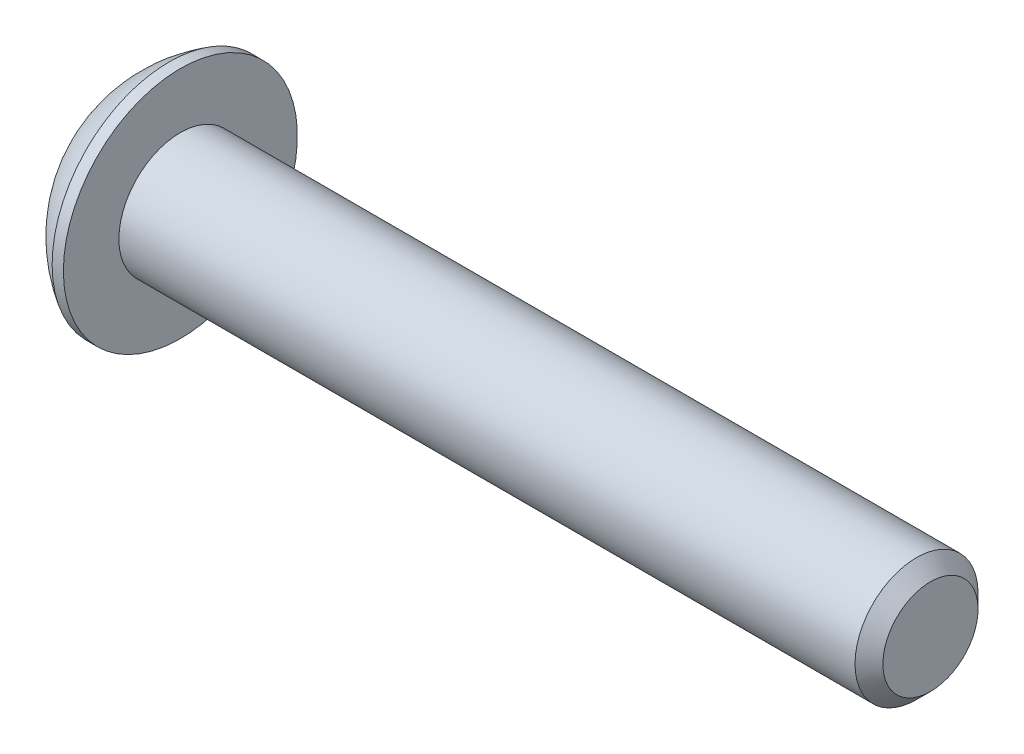
ISO-10303-21;
HEADER;
FILE_DESCRIPTION(('STEP AP214'),'2;1');
FILE_NAME('part.step','',(''),(''),'','','');
FILE_SCHEMA(('AUTOMOTIVE_DESIGN { 1 0 10303 214 1 1 1 1 }'));
ENDSEC;
DATA;
#1=APPLICATION_CONTEXT('core data for automotive mechanical design processes');
#2=APPLICATION_PROTOCOL_DEFINITION('international standard','automotive_design',2000,#1);
#3=PRODUCT_CONTEXT('',#1,'mechanical');
#4=PRODUCT('Part','Part','',(#3));
#5=PRODUCT_RELATED_PRODUCT_CATEGORY('part','',(#4));
#6=PRODUCT_DEFINITION_FORMATION('','',#4);
#7=PRODUCT_DEFINITION_CONTEXT('part definition',#1,'design');
#8=PRODUCT_DEFINITION('design','',#6,#7);
#9=PRODUCT_DEFINITION_SHAPE('','',#8);
#10=(LENGTH_UNIT() NAMED_UNIT(*) SI_UNIT(.MILLI.,.METRE.));
#11=(NAMED_UNIT(*) PLANE_ANGLE_UNIT() SI_UNIT($,.RADIAN.));
#12=(NAMED_UNIT(*) SI_UNIT($,.STERADIAN.) SOLID_ANGLE_UNIT());
#13=UNCERTAINTY_MEASURE_WITH_UNIT(LENGTH_MEASURE(1.E-05),#10,'distance_accuracy_value','');
#14=(GEOMETRIC_REPRESENTATION_CONTEXT(3) GLOBAL_UNCERTAINTY_ASSIGNED_CONTEXT((#13)) GLOBAL_UNIT_ASSIGNED_CONTEXT((#10,
#11,#12)) REPRESENTATION_CONTEXT('',''));
#15=CARTESIAN_POINT('',(0.,0.,0.));
#16=DIRECTION('',(0.,0.,1.));
#17=DIRECTION('',(1.,0.,0.));
#18=AXIS2_PLACEMENT_3D('',#15,#16,#17);
#19=CARTESIAN_POINT('',(1.32080000000034,0.,0.));
#20=DIRECTION('',(-1.,0.,0.));
#21=DIRECTION('',(0.,0.,1.));
#22=AXIS2_PLACEMENT_3D('',#19,#20,#21);
#23=CONICAL_SURFACE('',#22,1.1937999999998,1.04719755119608);
#24=CARTESIAN_POINT('',(2.01004075135902,0.,4.44089209850063E-13));
#25=VERTEX_POINT('',#24);
#26=VERTEX_LOOP('',#25);
#27=FACE_BOUND('',#26,.T.);
#28=CARTESIAN_POINT('',(1.32080000000009,0.,0.));
#29=DIRECTION('',(-1.,0.,0.));
#30=DIRECTION('',(0.,0.,1.));
#31=AXIS2_PLACEMENT_3D('',#28,#29,#30);
#32=CIRCLE('',#31,1.19380000000024);
#33=CARTESIAN_POINT('',(1.32080000000004,-1.03386112703797,0.59690000000006));
#34=VERTEX_POINT('',#33);
#35=CARTESIAN_POINT('',(1.32080000000004,0.,1.19380000000012));
#36=VERTEX_POINT('',#35);
#37=EDGE_CURVE('E19',#34,#36,#32,.T.);
#38=ORIENTED_EDGE('',*,*,#37,.T.);
#39=CARTESIAN_POINT('',(1.32080000000009,0.,0.));
#40=DIRECTION('',(-1.,0.,0.));
#41=DIRECTION('',(0.,0.,1.));
#42=AXIS2_PLACEMENT_3D('',#39,#40,#41);
#43=CIRCLE('',#42,1.19380000000024);
#44=CARTESIAN_POINT('',(1.32080000000004,1.03386112703797,0.596900000000061));
#45=VERTEX_POINT('',#44);
#46=EDGE_CURVE('E148',#36,#45,#43,.T.);
#47=ORIENTED_EDGE('',*,*,#46,.T.);
#48=CARTESIAN_POINT('',(1.32080000000009,0.,0.));
#49=DIRECTION('',(-1.,0.,0.));
#50=DIRECTION('',(0.,0.,1.));
#51=AXIS2_PLACEMENT_3D('',#48,#49,#50);
#52=CIRCLE('',#51,1.19380000000024);
#53=CARTESIAN_POINT('',(1.32080000000004,1.03386112703797,-0.596900000000061));
#54=VERTEX_POINT('',#53);
#55=EDGE_CURVE('E318',#45,#54,#52,.T.);
#56=ORIENTED_EDGE('',*,*,#55,.T.);
#57=CARTESIAN_POINT('',(1.32080000000009,0.,0.));
#58=DIRECTION('',(-1.,0.,0.));
#59=DIRECTION('',(0.,0.,1.));
#60=AXIS2_PLACEMENT_3D('',#57,#58,#59);
#61=CIRCLE('',#60,1.19380000000024);
#62=CARTESIAN_POINT('',(1.32080000000004,1.49457637585666E-12,-1.19380000000012));
#63=VERTEX_POINT('',#62);
#64=EDGE_CURVE('E319',#54,#63,#61,.T.);
#65=ORIENTED_EDGE('',*,*,#64,.T.);
#66=CARTESIAN_POINT('',(1.32080000000009,0.,0.));
#67=DIRECTION('',(-1.,0.,0.));
#68=DIRECTION('',(0.,0.,1.));
#69=AXIS2_PLACEMENT_3D('',#66,#67,#68);
#70=CIRCLE('',#69,1.19380000000024);
#71=CARTESIAN_POINT('',(1.32080000000004,-1.03386112703797,-0.59690000000006));
#72=VERTEX_POINT('',#71);
#73=EDGE_CURVE('E92',#63,#72,#70,.T.);
#74=ORIENTED_EDGE('',*,*,#73,.T.);
#75=CARTESIAN_POINT('',(1.32080000000009,0.,0.));
#76=DIRECTION('',(-1.,0.,0.));
#77=DIRECTION('',(0.,0.,1.));
#78=AXIS2_PLACEMENT_3D('',#75,#76,#77);
#79=CIRCLE('',#78,1.19380000000024);
#80=EDGE_CURVE('E88',#72,#34,#79,.T.);
#81=ORIENTED_EDGE('',*,*,#80,.T.);
#82=EDGE_LOOP('',(#38,#47,#56,#65,#74,#81));
#83=FACE_BOUND('',#82,.T.);
#84=ADVANCED_FACE('F16',(#27,#83),#23,.F.);
#85=CARTESIAN_POINT('',(1.3208,-2.06772225407572,-1.1938));
#86=DIRECTION('',(1.,0.,0.));
#87=DIRECTION('',(0.,0.,-1.));
#88=AXIS2_PLACEMENT_3D('',#85,#86,#87);
#89=PLANE('',#88);
#90=DIRECTION('',(0.,0.5,0.866025403784439));
#91=VECTOR('',#90,1.);
#92=CARTESIAN_POINT('',(1.3208,-1.37848150271715,0.));
#93=LINE('',#92,#91);
#94=CARTESIAN_POINT('',(1.3208,-0.689240751358574,1.1938));
#95=VERTEX_POINT('',#94);
#96=EDGE_CURVE('E100',#95,#34,#93,.F.);
#97=ORIENTED_EDGE('',*,*,#96,.F.);
#98=DIRECTION('',(0.,1.,0.));
#99=VECTOR('',#98,1.);
#100=CARTESIAN_POINT('',(1.3208,-0.689240751358574,1.1938));
#101=LINE('',#100,#99);
#102=EDGE_CURVE('E102',#36,#95,#101,.F.);
#103=ORIENTED_EDGE('',*,*,#102,.F.);
#104=ORIENTED_EDGE('',*,*,#37,.F.);
#105=EDGE_LOOP('',(#97,#103,#104));
#106=FACE_BOUND('',#105,.T.);
#107=ADVANCED_FACE('F98',(#106),#89,.F.);
#108=CARTESIAN_POINT('',(1.3208,-2.06772225407572,-1.1938));
#109=DIRECTION('',(1.,0.,0.));
#110=DIRECTION('',(0.,0.,-1.));
#111=AXIS2_PLACEMENT_3D('',#108,#109,#110);
#112=PLANE('',#111);
#113=DIRECTION('',(0.,-0.5,0.866025403784439));
#114=VECTOR('',#113,1.);
#115=CARTESIAN_POINT('',(1.3208,-0.689240751358574,-1.1938));
#116=LINE('',#115,#114);
#117=CARTESIAN_POINT('',(1.3208,-1.37848150271715,0.));
#118=VERTEX_POINT('',#117);
#119=EDGE_CURVE('E108',#118,#72,#116,.F.);
#120=ORIENTED_EDGE('',*,*,#119,.F.);
#121=DIRECTION('',(0.,0.5,0.866025403784439));
#122=VECTOR('',#121,1.);
#123=CARTESIAN_POINT('',(1.3208,-1.37848150271715,0.));
#124=LINE('',#123,#122);
#125=EDGE_CURVE('E105',#34,#118,#124,.F.);
#126=ORIENTED_EDGE('',*,*,#125,.F.);
#127=ORIENTED_EDGE('',*,*,#80,.F.);
#128=EDGE_LOOP('',(#120,#126,#127));
#129=FACE_BOUND('',#128,.T.);
#130=ADVANCED_FACE('F106',(#129),#112,.F.);
#131=CARTESIAN_POINT('',(1.3208,-2.06772225407572,-1.1938));
#132=DIRECTION('',(1.,0.,0.));
#133=DIRECTION('',(0.,0.,-1.));
#134=AXIS2_PLACEMENT_3D('',#131,#132,#133);
#135=PLANE('',#134);
#136=DIRECTION('',(0.,1.,0.));
#137=VECTOR('',#136,1.);
#138=CARTESIAN_POINT('',(1.3208,0.689240751358577,-1.1938));
#139=LINE('',#138,#137);
#140=CARTESIAN_POINT('',(1.3208,-0.689240751358574,-1.1938));
#141=VERTEX_POINT('',#140);
#142=EDGE_CURVE('E288',#141,#63,#139,.T.);
#143=ORIENTED_EDGE('',*,*,#142,.F.);
#144=DIRECTION('',(0.,-0.5,0.866025403784439));
#145=VECTOR('',#144,1.);
#146=CARTESIAN_POINT('',(1.3208,-0.689240751358574,-1.1938));
#147=LINE('',#146,#145);
#148=EDGE_CURVE('E300',#72,#141,#147,.F.);
#149=ORIENTED_EDGE('',*,*,#148,.F.);
#150=ORIENTED_EDGE('',*,*,#73,.F.);
#151=EDGE_LOOP('',(#143,#149,#150));
#152=FACE_BOUND('',#151,.T.);
#153=ADVANCED_FACE('F191',(#152),#135,.F.);
#154=CARTESIAN_POINT('',(1.3208,-2.06772225407572,-1.1938));
#155=DIRECTION('',(1.,0.,0.));
#156=DIRECTION('',(0.,0.,-1.));
#157=AXIS2_PLACEMENT_3D('',#154,#155,#156);
#158=PLANE('',#157);
#159=DIRECTION('',(0.,-0.5,-0.866025403784439));
#160=VECTOR('',#159,1.);
#161=CARTESIAN_POINT('',(1.3208,1.37848150271715,0.));
#162=LINE('',#161,#160);
#163=CARTESIAN_POINT('',(1.3208,0.689240751358577,-1.1938));
#164=VERTEX_POINT('',#163);
#165=EDGE_CURVE('E274',#164,#54,#162,.F.);
#166=ORIENTED_EDGE('',*,*,#165,.F.);
#167=DIRECTION('',(0.,1.,0.));
#168=VECTOR('',#167,1.);
#169=CARTESIAN_POINT('',(1.3208,0.689240751358577,-1.1938));
#170=LINE('',#169,#168);
#171=EDGE_CURVE('E285',#63,#164,#170,.T.);
#172=ORIENTED_EDGE('',*,*,#171,.F.);
#173=ORIENTED_EDGE('',*,*,#64,.F.);
#174=EDGE_LOOP('',(#166,#172,#173));
#175=FACE_BOUND('',#174,.T.);
#176=ADVANCED_FACE('F187',(#175),#158,.F.);
#177=CARTESIAN_POINT('',(1.3208,-2.06772225407572,-1.1938));
#178=DIRECTION('',(1.,0.,0.));
#179=DIRECTION('',(0.,0.,-1.));
#180=AXIS2_PLACEMENT_3D('',#177,#178,#179);
#181=PLANE('',#180);
#182=DIRECTION('',(0.,0.5,-0.866025403784439));
#183=VECTOR('',#182,1.);
#184=CARTESIAN_POINT('',(1.3208,0.689240751358576,1.1938));
#185=LINE('',#184,#183);
#186=CARTESIAN_POINT('',(1.3208,1.37848150271715,0.));
#187=VERTEX_POINT('',#186);
#188=EDGE_CURVE('E253',#187,#45,#185,.F.);
#189=ORIENTED_EDGE('',*,*,#188,.F.);
#190=DIRECTION('',(0.,-0.5,-0.866025403784439));
#191=VECTOR('',#190,1.);
#192=CARTESIAN_POINT('',(1.3208,1.37848150271715,0.));
#193=LINE('',#192,#191);
#194=EDGE_CURVE('E272',#54,#187,#193,.F.);
#195=ORIENTED_EDGE('',*,*,#194,.F.);
#196=ORIENTED_EDGE('',*,*,#55,.F.);
#197=EDGE_LOOP('',(#189,#195,#196));
#198=FACE_BOUND('',#197,.T.);
#199=ADVANCED_FACE('F183',(#198),#181,.F.);
#200=CARTESIAN_POINT('',(1.3208,-2.06772225407572,-1.1938));
#201=DIRECTION('',(1.,0.,0.));
#202=DIRECTION('',(0.,0.,-1.));
#203=AXIS2_PLACEMENT_3D('',#200,#201,#202);
#204=PLANE('',#203);
#205=DIRECTION('',(0.,1.,0.));
#206=VECTOR('',#205,1.);
#207=CARTESIAN_POINT('',(1.3208,-0.689240751358574,1.1938));
#208=LINE('',#207,#206);
#209=CARTESIAN_POINT('',(1.3208,0.689240751358576,1.1938));
#210=VERTEX_POINT('',#209);
#211=EDGE_CURVE('E117',#210,#36,#208,.F.);
#212=ORIENTED_EDGE('',*,*,#211,.F.);
#213=DIRECTION('',(0.,0.5,-0.866025403784439));
#214=VECTOR('',#213,1.);
#215=CARTESIAN_POINT('',(1.3208,0.689240751358576,1.1938));
#216=LINE('',#215,#214);
#217=EDGE_CURVE('E256',#45,#210,#216,.F.);
#218=ORIENTED_EDGE('',*,*,#217,.F.);
#219=ORIENTED_EDGE('',*,*,#46,.F.);
#220=EDGE_LOOP('',(#212,#218,#219));
#221=FACE_BOUND('',#220,.T.);
#222=ADVANCED_FACE('F179',(#221),#204,.F.);
#223=CARTESIAN_POINT('',(1.3208,-0.689240751358574,1.1938));
#224=DIRECTION('',(0.,0.,-1.));
#225=DIRECTION('',(0.,1.,0.));
#226=AXIS2_PLACEMENT_3D('',#223,#224,#225);
#227=PLANE('',#226);
#228=DIRECTION('',(0.,1.,0.));
#229=VECTOR('',#228,1.);
#230=CARTESIAN_POINT('',(0.,0.,1.1938));
#231=LINE('',#230,#229);
#232=CARTESIAN_POINT('',(0.,0.689240751358577,1.1938));
#233=VERTEX_POINT('',#232);
#234=CARTESIAN_POINT('',(0.,-0.689240751358574,1.1938));
#235=VERTEX_POINT('',#234);
#236=EDGE_CURVE('E250',#233,#235,#231,.F.);
#237=ORIENTED_EDGE('',*,*,#236,.F.);
#238=DIRECTION('',(1.,0.,0.));
#239=VECTOR('',#238,1.);
#240=CARTESIAN_POINT('',(1.3208,0.689240751358576,1.1938));
#241=LINE('',#240,#239);
#242=EDGE_CURVE('E262',#210,#233,#241,.F.);
#243=ORIENTED_EDGE('',*,*,#242,.F.);
#244=ORIENTED_EDGE('',*,*,#211,.T.);
#245=ORIENTED_EDGE('',*,*,#102,.T.);
#246=DIRECTION('',(1.,0.,0.));
#247=VECTOR('',#246,1.);
#248=CARTESIAN_POINT('',(1.3208,-0.689240751358574,1.1938));
#249=LINE('',#248,#247);
#250=EDGE_CURVE('E111',#235,#95,#249,.T.);
#251=ORIENTED_EDGE('',*,*,#250,.F.);
#252=EDGE_LOOP('',(#237,#243,#244,#245,#251));
#253=FACE_BOUND('',#252,.T.);
#254=ADVANCED_FACE('F176',(#253),#227,.T.);
#255=CARTESIAN_POINT('',(1.3208,-1.37848150271715,0.));
#256=DIRECTION('',(0.,0.866025403784439,-0.5));
#257=DIRECTION('',(0.,0.5,0.866025403784439));
#258=AXIS2_PLACEMENT_3D('',#255,#256,#257);
#259=PLANE('',#258);
#260=DIRECTION('',(0.,-0.5,-0.866025403784439));
#261=VECTOR('',#260,1.);
#262=CARTESIAN_POINT('',(0.,-0.689240751358574,1.1938));
#263=LINE('',#262,#261);
#264=CARTESIAN_POINT('',(0.,-1.37848150271715,0.));
#265=VERTEX_POINT('',#264);
#266=EDGE_CURVE('E247',#235,#265,#263,.T.);
#267=ORIENTED_EDGE('',*,*,#266,.F.);
#268=ORIENTED_EDGE('',*,*,#250,.T.);
#269=ORIENTED_EDGE('',*,*,#96,.T.);
#270=ORIENTED_EDGE('',*,*,#125,.T.);
#271=DIRECTION('',(1.,0.,0.));
#272=VECTOR('',#271,1.);
#273=CARTESIAN_POINT('',(1.3208,-1.37848150271715,0.));
#274=LINE('',#273,#272);
#275=EDGE_CURVE('E297',#265,#118,#274,.T.);
#276=ORIENTED_EDGE('',*,*,#275,.F.);
#277=EDGE_LOOP('',(#267,#268,#269,#270,#276));
#278=FACE_BOUND('',#277,.T.);
#279=ADVANCED_FACE('F115',(#278),#259,.T.);
#280=CARTESIAN_POINT('',(1.3208,-0.689240751358574,-1.1938));
#281=DIRECTION('',(0.,0.866025403784439,0.5));
#282=DIRECTION('',(0.,-0.5,0.866025403784439));
#283=AXIS2_PLACEMENT_3D('',#280,#281,#282);
#284=PLANE('',#283);
#285=DIRECTION('',(0.,0.5,-0.866025403784439));
#286=VECTOR('',#285,1.);
#287=CARTESIAN_POINT('',(0.,-1.37848150271715,0.));
#288=LINE('',#287,#286);
#289=CARTESIAN_POINT('',(0.,-0.689240751358574,-1.1938));
#290=VERTEX_POINT('',#289);
#291=EDGE_CURVE('E244',#265,#290,#288,.T.);
#292=ORIENTED_EDGE('',*,*,#291,.F.);
#293=ORIENTED_EDGE('',*,*,#275,.T.);
#294=ORIENTED_EDGE('',*,*,#119,.T.);
#295=ORIENTED_EDGE('',*,*,#148,.T.);
#296=DIRECTION('',(1.,0.,0.));
#297=VECTOR('',#296,1.);
#298=CARTESIAN_POINT('',(1.3208,-0.689240751358574,-1.1938));
#299=LINE('',#298,#297);
#300=EDGE_CURVE('E282',#290,#141,#299,.T.);
#301=ORIENTED_EDGE('',*,*,#300,.F.);
#302=EDGE_LOOP('',(#292,#293,#294,#295,#301));
#303=FACE_BOUND('',#302,.T.);
#304=ADVANCED_FACE('F169',(#303),#284,.T.);
#305=CARTESIAN_POINT('',(1.3208,0.689240751358577,-1.1938));
#306=DIRECTION('',(0.,0.,1.));
#307=DIRECTION('',(1.,0.,0.));
#308=AXIS2_PLACEMENT_3D('',#305,#306,#307);
#309=PLANE('',#308);
#310=DIRECTION('',(0.,1.,0.));
#311=VECTOR('',#310,1.);
#312=CARTESIAN_POINT('',(0.,0.,-1.1938));
#313=LINE('',#312,#311);
#314=CARTESIAN_POINT('',(0.,0.689240751358577,-1.1938));
#315=VERTEX_POINT('',#314);
#316=EDGE_CURVE('E241',#290,#315,#313,.T.);
#317=ORIENTED_EDGE('',*,*,#316,.F.);
#318=ORIENTED_EDGE('',*,*,#300,.T.);
#319=ORIENTED_EDGE('',*,*,#142,.T.);
#320=ORIENTED_EDGE('',*,*,#171,.T.);
#321=DIRECTION('',(1.,0.,0.));
#322=VECTOR('',#321,1.);
#323=CARTESIAN_POINT('',(1.3208,0.689240751358577,-1.1938));
#324=LINE('',#323,#322);
#325=EDGE_CURVE('E257',#315,#164,#324,.T.);
#326=ORIENTED_EDGE('',*,*,#325,.F.);
#327=EDGE_LOOP('',(#317,#318,#319,#320,#326));
#328=FACE_BOUND('',#327,.T.);
#329=ADVANCED_FACE('F166',(#328),#309,.T.);
#330=CARTESIAN_POINT('',(1.3208,1.37848150271715,0.));
#331=DIRECTION('',(0.,-0.866025403784439,0.5));
#332=DIRECTION('',(0.,-0.5,-0.866025403784439));
#333=AXIS2_PLACEMENT_3D('',#330,#331,#332);
#334=PLANE('',#333);
#335=DIRECTION('',(0.,0.5,0.866025403784439));
#336=VECTOR('',#335,1.);
#337=CARTESIAN_POINT('',(0.,0.689240751358577,-1.1938));
#338=LINE('',#337,#336);
#339=CARTESIAN_POINT('',(0.,1.37848150271715,0.));
#340=VERTEX_POINT('',#339);
#341=EDGE_CURVE('E238',#315,#340,#338,.T.);
#342=ORIENTED_EDGE('',*,*,#341,.F.);
#343=ORIENTED_EDGE('',*,*,#325,.T.);
#344=ORIENTED_EDGE('',*,*,#165,.T.);
#345=ORIENTED_EDGE('',*,*,#194,.T.);
#346=DIRECTION('',(1.,0.,0.));
#347=VECTOR('',#346,1.);
#348=CARTESIAN_POINT('',(1.3208,1.37848150271715,0.));
#349=LINE('',#348,#347);
#350=EDGE_CURVE('E34',#340,#187,#349,.T.);
#351=ORIENTED_EDGE('',*,*,#350,.F.);
#352=EDGE_LOOP('',(#342,#343,#344,#345,#351));
#353=FACE_BOUND('',#352,.T.);
#354=ADVANCED_FACE('F162',(#353),#334,.T.);
#355=CARTESIAN_POINT('',(1.3208,0.689240751358576,1.1938));
#356=DIRECTION('',(0.,-0.866025403784439,-0.5));
#357=DIRECTION('',(0.,0.5,-0.866025403784439));
#358=AXIS2_PLACEMENT_3D('',#355,#356,#357);
#359=PLANE('',#358);
#360=DIRECTION('',(0.,-0.5,0.866025403784439));
#361=VECTOR('',#360,1.);
#362=CARTESIAN_POINT('',(0.,1.37848150271715,0.));
#363=LINE('',#362,#361);
#364=EDGE_CURVE('E147',#340,#233,#363,.T.);
#365=ORIENTED_EDGE('',*,*,#364,.F.);
#366=ORIENTED_EDGE('',*,*,#350,.T.);
#367=ORIENTED_EDGE('',*,*,#188,.T.);
#368=ORIENTED_EDGE('',*,*,#217,.T.);
#369=ORIENTED_EDGE('',*,*,#242,.T.);
#370=EDGE_LOOP('',(#365,#366,#367,#368,#369));
#371=FACE_BOUND('',#370,.T.);
#372=ADVANCED_FACE('F158',(#371),#359,.T.);
#373=CARTESIAN_POINT('',(0.,0.,0.));
#374=DIRECTION('',(-1.,0.,0.));
#375=DIRECTION('',(0.,0.,1.));
#376=AXIS2_PLACEMENT_3D('',#373,#374,#375);
#377=PLANE('',#376);
#378=ORIENTED_EDGE('',*,*,#341,.T.);
#379=ORIENTED_EDGE('',*,*,#364,.T.);
#380=ORIENTED_EDGE('',*,*,#236,.T.);
#381=ORIENTED_EDGE('',*,*,#266,.T.);
#382=ORIENTED_EDGE('',*,*,#291,.T.);
#383=ORIENTED_EDGE('',*,*,#316,.T.);
#384=EDGE_LOOP('',(#378,#379,#380,#381,#382,#383));
#385=FACE_BOUND('',#384,.T.);
#386=CARTESIAN_POINT('',(0.,1.9812,0.));
#387=CARTESIAN_POINT('',(0.,1.9811996664299,0.0556258831179428));
#388=CARTESIAN_POINT('',(0.,1.97885520380442,0.111261989398606));
#389=CARTESIAN_POINT('',(0.,1.96949260169541,0.222149719830458));
#390=CARTESIAN_POINT('',(0.,1.96247308239605,0.277401225602895));
#391=CARTESIAN_POINT('',(0.,1.94379192841038,0.387209508139747));
#392=CARTESIAN_POINT('',(-1.85325793235264E-13,1.93212292489526,0.441765039546365));
#393=CARTESIAN_POINT('',(1.86344214223505E-13,1.90422331175315,0.549729449347493));
#394=CARTESIAN_POINT('',(6.94543371897454E-13,1.88798900035338,0.603137359208869));
#395=CARTESIAN_POINT('',(1.15501975216981E-12,1.83266214476501,0.760839131321828));
#396=CARTESIAN_POINT('',(0.,1.78690023648845,0.862876433575429));
#397=CARTESIAN_POINT('',(0.,1.67887358150667,1.05780719540872));
#398=CARTESIAN_POINT('',(9.54193214892627E-13,1.6166082074585,1.15070030720801));
#399=CARTESIAN_POINT('',(5.94805591894675E-13,1.51224157140982,1.28116890915697));
#400=CARTESIAN_POINT('',(1.63221293851378E-13,1.4755970394354,1.32320451127026));
#401=CARTESIAN_POINT('',(-1.62196980336157E-13,1.39893832619713,1.40400288695709));
#402=CARTESIAN_POINT('',(0.,1.35892742784698,1.44276877695455));
#403=CARTESIAN_POINT('',(1.14362537325405E-13,1.23416504602197,1.55382272417904));
#404=CARTESIAN_POINT('',(0.,1.14466125559859,1.62089527952111));
#405=CARTESIAN_POINT('',(0.,0.955712144178167,1.7390221808118));
#406=CARTESIAN_POINT('',(0.,0.856267198233564,1.79007713076007));
#407=CARTESIAN_POINT('',(0.,0.650206345910843,1.87477637530954));
#408=CARTESIAN_POINT('',(0.,0.543590516134855,1.90842085586267));
#409=CARTESIAN_POINT('',(0.,0.326226155292018,1.95733039300656));
#410=CARTESIAN_POINT('',(0.,0.21547760215793,1.97259535144288));
#411=CARTESIAN_POINT('',(0.,-0.00701040587544639,1.98431697865418));
#412=CARTESIAN_POINT('',(0.,-0.118749860774734,1.98077364742917));
#413=CARTESIAN_POINT('',(0.,-0.340050178355485,1.95497485623825));
#414=CARTESIAN_POINT('',(0.,-0.449611052668255,1.93271949620218));
#415=CARTESIAN_POINT('',(0.,-0.663431110729174,1.87014138774523));
#416=CARTESIAN_POINT('',(0.,-0.76769023783852,1.82981844635272));
#417=CARTESIAN_POINT('',(0.,-0.968005760719347,1.73219968377096));
#418=CARTESIAN_POINT('',(0.,-1.0640618469811,1.6749032225164));
#419=CARTESIAN_POINT('',(0.,-1.19980276751283,1.57757371205873));
#420=CARTESIAN_POINT('',(0.,-1.24366557129213,1.54322665019466));
#421=CARTESIAN_POINT('',(0.,-1.32838995706696,1.47093063174264));
#422=CARTESIAN_POINT('',(0.,-1.36924860178706,1.43297823102439));
#423=CARTESIAN_POINT('',(0.,-1.48674671849223,1.31419842051173));
#424=CARTESIAN_POINT('',(0.,-1.55842832343237,1.22836221289311));
#425=CARTESIAN_POINT('',(0.,-1.6863396856475,1.04586168272493));
#426=CARTESIAN_POINT('',(0.,-1.7425700302488,0.949197771949774));
#427=CARTESIAN_POINT('',(0.,-1.8141614250401,0.798182600298684));
#428=CARTESIAN_POINT('',(0.,-1.83591780585875,0.746776203847791));
#429=CARTESIAN_POINT('',(0.,-1.87500754181092,0.642341081688636));
#430=CARTESIAN_POINT('',(0.,-1.89234447645404,0.589313708122847));
#431=CARTESIAN_POINT('',(0.,-1.92246053433554,0.482076273028395));
#432=CARTESIAN_POINT('',(0.,-1.93524685475118,0.42786822425751));
#433=CARTESIAN_POINT('',(0.,-1.95620937250494,0.318578151844611));
#434=CARTESIAN_POINT('',(0.,-1.96438692958147,0.263496390912872));
#435=CARTESIAN_POINT('',(0.,-1.97388528284653,0.173607715038558));
#436=CARTESIAN_POINT('',(0.,-1.97662743364426,0.138944718024998));
#437=CARTESIAN_POINT('',(0.,-1.98028489645283,0.0695224782567002));
#438=CARTESIAN_POINT('',(0.,-1.98120020846367,0.0347632355019631));
#439=CARTESIAN_POINT('',(0.,-1.9811996664299,-0.0556258831179437));
#440=CARTESIAN_POINT('',(0.,-1.97885520380442,-0.111261989398607));
#441=CARTESIAN_POINT('',(0.,-1.96949260169541,-0.222149719830459));
#442=CARTESIAN_POINT('',(0.,-1.96247308239605,-0.277401225602897));
#443=CARTESIAN_POINT('',(0.,-1.94379192841039,-0.387209508139749));
#444=CARTESIAN_POINT('',(-1.85269749640691E-13,-1.93212292489526,-0.441765039546367));
#445=CARTESIAN_POINT('',(1.86288125054388E-13,-1.90422331175315,-0.549729449347495));
#446=CARTESIAN_POINT('',(6.94525090263764E-13,-1.88798900035338,-0.603137359208872));
#447=CARTESIAN_POINT('',(1.15505622829081E-12,-1.83266214476501,-0.760839131321831));
#448=CARTESIAN_POINT('',(0.,-1.78690023648845,-0.862876433575431));
#449=CARTESIAN_POINT('',(0.,-1.67887358150667,-1.05780719540872));
#450=CARTESIAN_POINT('',(9.54248812869379E-13,-1.6166082074585,-1.15070030720801));
#451=CARTESIAN_POINT('',(5.94777756479239E-13,-1.51224157140982,-1.28116890915698));
#452=CARTESIAN_POINT('',(1.63138949183833E-13,-1.47559703943539,-1.32320451127027));
#453=CARTESIAN_POINT('',(-1.62114715061273E-13,-1.39893832619713,-1.40400288695709));
#454=CARTESIAN_POINT('',(0.,-1.35892742784699,-1.44276877695455));
#455=CARTESIAN_POINT('',(1.13760489124207E-13,-1.23416504602197,-1.55382272417904));
#456=CARTESIAN_POINT('',(0.,-1.14466125559859,-1.62089527952111));
#457=CARTESIAN_POINT('',(0.,-0.95571214417816,-1.73902218081179));
#458=CARTESIAN_POINT('',(0.,-0.856267198233559,-1.79007713076007));
#459=CARTESIAN_POINT('',(0.,-0.650206345910841,-1.87477637530954));
#460=CARTESIAN_POINT('',(0.,-0.543590516134854,-1.90842085586267));
#461=CARTESIAN_POINT('',(0.,-0.326226155292018,-1.95733039300657));
#462=CARTESIAN_POINT('',(0.,-0.215477602157929,-1.97259535144288));
#463=CARTESIAN_POINT('',(0.,0.0070104058754487,-1.98431697865418));
#464=CARTESIAN_POINT('',(0.,0.118749860774737,-1.98077364742916));
#465=CARTESIAN_POINT('',(0.,0.340050178355489,-1.95497485623824));
#466=CARTESIAN_POINT('',(0.,0.44961105266826,-1.93271949620218));
#467=CARTESIAN_POINT('',(0.,0.663431110729178,-1.87014138774524));
#468=CARTESIAN_POINT('',(0.,0.767690237838524,-1.82981844635272));
#469=CARTESIAN_POINT('',(0.,0.968005760719348,-1.73219968377096));
#470=CARTESIAN_POINT('',(0.,1.0640618469811,-1.67490322251639));
#471=CARTESIAN_POINT('',(0.,1.19980276751283,-1.57757371205873));
#472=CARTESIAN_POINT('',(0.,1.24366557129214,-1.54322665019465));
#473=CARTESIAN_POINT('',(0.,1.32838995706696,-1.47093063174263));
#474=CARTESIAN_POINT('',(0.,1.36924860178706,-1.43297823102439));
#475=CARTESIAN_POINT('',(0.,1.48674671849223,-1.31419842051172));
#476=CARTESIAN_POINT('',(0.,1.55842832343237,-1.22836221289311));
#477=CARTESIAN_POINT('',(0.,1.6863396856475,-1.04586168272492));
#478=CARTESIAN_POINT('',(0.,1.7425700302488,-0.949197771949768));
#479=CARTESIAN_POINT('',(0.,1.8141614250401,-0.798182600298677));
#480=CARTESIAN_POINT('',(0.,1.83591780585875,-0.746776203847785));
#481=CARTESIAN_POINT('',(0.,1.87500754181092,-0.64234108168863));
#482=CARTESIAN_POINT('',(0.,1.89234447645404,-0.589313708122841));
#483=CARTESIAN_POINT('',(0.,1.92246053433555,-0.482076273028389));
#484=CARTESIAN_POINT('',(0.,1.93524685475118,-0.427868224257505));
#485=CARTESIAN_POINT('',(0.,1.95620937250494,-0.318578151844605));
#486=CARTESIAN_POINT('',(0.,1.96438692958147,-0.263496390912866));
#487=CARTESIAN_POINT('',(0.,1.97388528284653,-0.173607715038553));
#488=CARTESIAN_POINT('',(0.,1.97662743364426,-0.138944718024994));
#489=CARTESIAN_POINT('',(0.,1.98028489645283,-0.0695224782566989));
#490=CARTESIAN_POINT('',(0.,1.98120020846367,-0.034763235501963));
#491=CARTESIAN_POINT('',(0.,1.9812,0.));
#492=B_SPLINE_CURVE_WITH_KNOTS('',3,(#386,#387,#388,#389,#390,#391,#392,#393,#394,#395,#396,
#397,#398,#399,#400,#401,#402,#403,#404,#405,#406,#407,#408,#409,#410,#411,#412,#413,#414,#415,
#416,#417,#418,#419,#420,#421,#422,#423,#424,#425,#426,#427,#428,#429,#430,#431,#432,#433,#434,
#435,#436,#437,#438,#439,#440,#441,#442,#443,#444,#445,#446,#447,#448,#449,#450,#451,#452,#453,
#454,#455,#456,#457,#458,#459,#460,#461,#462,#463,#464,#465,#466,#467,#468,#469,#470,#471,#472,
#473,#474,#475,#476,#477,#478,#479,#480,#481,#482,#483,#484,#485,#486,#487,#488,#489,#490,#491),
.UNSPECIFIED.,.T.,.F.,(4,2,2,2,2,2,2,2,2,2,2,2,2,2,2,2,2,2,2,2,2,2,2,2,2,2,2,2,2,2,2,2,2,2,2,2,
2,2,2,2,2,2,2,2,2,2,2,2,2,2,2,2,4),(0.,0.166845646007828,0.333740557374255,0.500901034367693,
0.668197445942386,1.00199278686282,1.33580081809885,1.50292354032982,1.6698851310853,
2.00370118900129,2.33750465770544,2.67130456115909,3.005106247238,3.33890793331696,
3.67270783677065,4.00651130547476,4.34032736339026,4.50728895414554,4.67441167637632,
5.00821970761259,5.34201504853332,5.50931146010827,5.67647193710191,5.84336684846844,
6.0102124944764,6.11448220058334,6.21875190669029,6.38559755269812,6.55249246406454,
6.71965294105798,6.88694935263268,7.22074469355311,7.55455272478915,7.72167544702011,
7.88863703777559,8.22245309569158,8.55625656439573,8.89005646784938,9.2238581539283,
9.55765984000725,9.89145974346094,10.2252632121651,10.5590792700806,10.7260408608358,
10.8931635830666,11.2269716143029,11.5607669552236,11.7280633667986,11.8952238437922,
12.0621187551587,12.2289644011667,12.3332341072736,12.4375038133806),.UNSPECIFIED.);
#493=CARTESIAN_POINT('',(0.,1.9812,0.));
#494=VERTEX_POINT('',#493);
#495=EDGE_CURVE('E139',#494,#494,#492,.T.);
#496=ORIENTED_EDGE('',*,*,#495,.F.);
#497=EDGE_LOOP('',(#496));
#498=FACE_BOUND('',#497,.T.);
#499=ADVANCED_FACE('F154',(#385,#498),#377,.T.);
#500=CARTESIAN_POINT('',(4.13385,0.,0.));
#501=DIRECTION('',(0.,1.,0.));
#502=DIRECTION('',(1.,0.,0.));
#503=AXIS2_PLACEMENT_3D('',#500,#501,#502);
#504=SPHERICAL_SURFACE('',#503,4.58408870578439);
#505=CARTESIAN_POINT('',(1.8288,0.,0.));
#506=DIRECTION('',(-1.,0.,0.));
#507=DIRECTION('',(0.,0.,1.));
#508=AXIS2_PLACEMENT_3D('',#505,#506,#507);
#509=CIRCLE('',#508,3.9624);
#510=CARTESIAN_POINT('',(1.8288,0.,3.9624));
#511=VERTEX_POINT('',#510);
#512=EDGE_CURVE('E136',#511,#511,#509,.F.);
#513=ORIENTED_EDGE('',*,*,#512,.F.);
#514=EDGE_LOOP('',(#513));
#515=FACE_BOUND('',#514,.T.);
#516=ORIENTED_EDGE('',*,*,#495,.T.);
#517=EDGE_LOOP('',(#516));
#518=FACE_BOUND('',#517,.T.);
#519=ADVANCED_FACE('F150',(#515,#518),#504,.T.);
#520=CARTESIAN_POINT('',(27.6098,0.,0.));
#521=DIRECTION('',(-1.,0.,0.));
#522=DIRECTION('',(0.,0.,1.));
#523=AXIS2_PLACEMENT_3D('',#520,#521,#522);
#524=PLANE('',#523);
#525=CARTESIAN_POINT('',(27.6097999999365,0.,0.));
#526=DIRECTION('',(-1.,0.,0.));
#527=DIRECTION('',(0.,-1.,0.));
#528=AXIS2_PLACEMENT_3D('',#525,#526,#527);
#529=CIRCLE('',#528,1.61036000002923);
#530=CARTESIAN_POINT('',(27.6097999999365,-1.61036000002923,0.));
#531=VERTEX_POINT('',#530);
#532=EDGE_CURVE('E133',#531,#531,#529,.T.);
#533=ORIENTED_EDGE('',*,*,#532,.F.);
#534=EDGE_LOOP('',(#533));
#535=FACE_BOUND('',#534,.T.);
#536=ADVANCED_FACE('F222',(#535),#524,.F.);
#537=CARTESIAN_POINT('',(0.,0.,0.));
#538=DIRECTION('',(-1.,0.,0.));
#539=DIRECTION('',(0.,0.,1.));
#540=AXIS2_PLACEMENT_3D('',#537,#538,#539);
#541=CYLINDRICAL_SURFACE('',#540,3.9624);
#542=ORIENTED_EDGE('',*,*,#512,.T.);
#543=EDGE_LOOP('',(#542));
#544=FACE_BOUND('',#543,.T.);
#545=CARTESIAN_POINT('',(2.2098,0.,0.));
#546=DIRECTION('',(-1.,0.,0.));
#547=DIRECTION('',(0.,0.,1.));
#548=AXIS2_PLACEMENT_3D('',#545,#546,#547);
#549=CIRCLE('',#548,3.9624);
#550=CARTESIAN_POINT('',(2.2098,0.,3.9624));
#551=VERTEX_POINT('',#550);
#552=EDGE_CURVE('E130',#551,#551,#549,.T.);
#553=ORIENTED_EDGE('',*,*,#552,.T.);
#554=EDGE_LOOP('',(#553));
#555=FACE_BOUND('',#554,.T.);
#556=ADVANCED_FACE('F219',(#544,#555),#541,.T.);
#557=CARTESIAN_POINT('',(27.1373600000402,0.,0.));
#558=DIRECTION('',(-1.,0.,0.));
#559=DIRECTION('',(0.,-1.,0.));
#560=AXIS2_PLACEMENT_3D('',#557,#558,#559);
#561=CONICAL_SURFACE('',#560,2.08279999992556,0.785398163397448);
#562=ORIENTED_EDGE('',*,*,#532,.T.);
#563=EDGE_LOOP('',(#562));
#564=FACE_BOUND('',#563,.T.);
#565=CARTESIAN_POINT('',(27.13736,0.,0.));
#566=DIRECTION('',(-1.,0.,0.));
#567=DIRECTION('',(0.,0.,1.));
#568=AXIS2_PLACEMENT_3D('',#565,#566,#567);
#569=CIRCLE('',#568,2.0828);
#570=CARTESIAN_POINT('',(27.13736,0.,2.0828));
#571=VERTEX_POINT('',#570);
#572=EDGE_CURVE('E25',#571,#571,#569,.T.);
#573=ORIENTED_EDGE('',*,*,#572,.F.);
#574=EDGE_LOOP('',(#573));
#575=FACE_BOUND('',#574,.T.);
#576=ADVANCED_FACE('F211',(#564,#575),#561,.T.);
#577=CARTESIAN_POINT('',(2.2098,2.0828,0.));
#578=DIRECTION('',(-1.,0.,0.));
#579=DIRECTION('',(0.,0.,1.));
#580=AXIS2_PLACEMENT_3D('',#577,#578,#579);
#581=PLANE('',#580);
#582=CARTESIAN_POINT('',(2.2098,0.,0.));
#583=DIRECTION('',(-1.,0.,0.));
#584=DIRECTION('',(0.,0.,1.));
#585=AXIS2_PLACEMENT_3D('',#582,#583,#584);
#586=CIRCLE('',#585,2.0828);
#587=CARTESIAN_POINT('',(2.2098,0.,2.0828));
#588=VERTEX_POINT('',#587);
#589=EDGE_CURVE('E11',#588,#588,#586,.F.);
#590=ORIENTED_EDGE('',*,*,#589,.F.);
#591=EDGE_LOOP('',(#590));
#592=FACE_BOUND('',#591,.T.);
#593=ORIENTED_EDGE('',*,*,#552,.F.);
#594=EDGE_LOOP('',(#593));
#595=FACE_BOUND('',#594,.T.);
#596=ADVANCED_FACE('F205',(#592,#595),#581,.F.);
#597=CARTESIAN_POINT('',(0.,0.,0.));
#598=DIRECTION('',(-1.,0.,0.));
#599=DIRECTION('',(0.,0.,1.));
#600=AXIS2_PLACEMENT_3D('',#597,#598,#599);
#601=CYLINDRICAL_SURFACE('',#600,2.0828);
#602=ORIENTED_EDGE('',*,*,#572,.T.);
#603=EDGE_LOOP('',(#602));
#604=FACE_BOUND('',#603,.T.);
#605=ORIENTED_EDGE('',*,*,#589,.T.);
#606=EDGE_LOOP('',(#605));
#607=FACE_BOUND('',#606,.T.);
#608=ADVANCED_FACE('F203',(#604,#607),#601,.T.);
#609=CLOSED_SHELL('',(#84,#107,#130,#153,#176,#199,#222,#254,#279,#304,#329,#354,#372,#499,#519,
#536,#556,#576,#596,#608));
#610=MANIFOLD_SOLID_BREP('B1',#609);
#611=ADVANCED_BREP_SHAPE_REPRESENTATION('',(#18,#610),#14);
#612=SHAPE_DEFINITION_REPRESENTATION(#9,#611);
ENDSEC;
END-ISO-10303-21;
